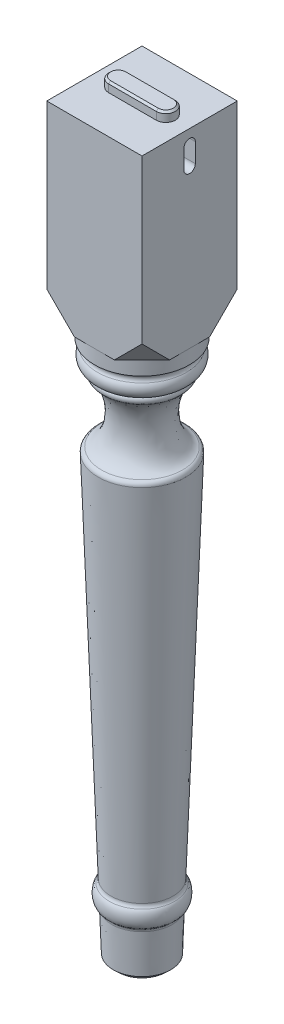
ISO-10303-21;
HEADER;
FILE_DESCRIPTION(('STEP AP214'),'2;1');
FILE_NAME('part.step','',(''),(''),'','','');
FILE_SCHEMA(('AUTOMOTIVE_DESIGN { 1 0 10303 214 1 1 1 1 }'));
ENDSEC;
DATA;
#1=APPLICATION_CONTEXT('core data for automotive mechanical design processes');
#2=APPLICATION_PROTOCOL_DEFINITION('international standard','automotive_design',2000,#1);
#3=PRODUCT_CONTEXT('',#1,'mechanical');
#4=PRODUCT('Part','Part','',(#3));
#5=PRODUCT_RELATED_PRODUCT_CATEGORY('part','',(#4));
#6=PRODUCT_DEFINITION_FORMATION('','',#4);
#7=PRODUCT_DEFINITION_CONTEXT('part definition',#1,'design');
#8=PRODUCT_DEFINITION('design','',#6,#7);
#9=PRODUCT_DEFINITION_SHAPE('','',#8);
#10=(LENGTH_UNIT() NAMED_UNIT(*) SI_UNIT(.MILLI.,.METRE.));
#11=(NAMED_UNIT(*) PLANE_ANGLE_UNIT() SI_UNIT($,.RADIAN.));
#12=(NAMED_UNIT(*) SI_UNIT($,.STERADIAN.) SOLID_ANGLE_UNIT());
#13=UNCERTAINTY_MEASURE_WITH_UNIT(LENGTH_MEASURE(1.E-05),#10,'distance_accuracy_value','');
#14=(GEOMETRIC_REPRESENTATION_CONTEXT(3) GLOBAL_UNCERTAINTY_ASSIGNED_CONTEXT((#13)) GLOBAL_UNIT_ASSIGNED_CONTEXT((#10,
#11,#12)) REPRESENTATION_CONTEXT('',''));
#15=CARTESIAN_POINT('',(0.,0.,0.));
#16=DIRECTION('',(0.,0.,1.));
#17=DIRECTION('',(1.,0.,0.));
#18=AXIS2_PLACEMENT_3D('',#15,#16,#17);
#19=CARTESIAN_POINT('',(0.,0.,0.));
#20=DIRECTION('',(0.,-1.,0.));
#21=DIRECTION('',(0.,0.,-1.));
#22=AXIS2_PLACEMENT_3D('',#19,#20,#21);
#23=PLANE('',#22);
#24=CARTESIAN_POINT('',(0.,0.,0.));
#25=DIRECTION('',(0.,-1.,0.));
#26=DIRECTION('',(0.,0.,-1.));
#27=AXIS2_PLACEMENT_3D('',#24,#25,#26);
#28=CIRCLE('',#27,24.8183506683762);
#29=CARTESIAN_POINT('',(0.,0.,-24.8183506683762));
#30=VERTEX_POINT('',#29);
#31=EDGE_CURVE('E307',#30,#30,#28,.T.);
#32=ORIENTED_EDGE('',*,*,#31,.T.);
#33=EDGE_LOOP('',(#32));
#34=FACE_BOUND('',#33,.T.);
#35=ADVANCED_FACE('F41',(#34),#23,.T.);
#36=CARTESIAN_POINT('',(0.,0.,0.));
#37=DIRECTION('',(0.,1.,0.));
#38=DIRECTION('',(0.,0.,1.));
#39=AXIS2_PLACEMENT_3D('',#36,#37,#38);
#40=CONICAL_SURFACE('',#39,30.,0.0344691009995081);
#41=CARTESIAN_POINT('',(0.,46.8280125464006,0.));
#42=DIRECTION('',(0.,1.,0.));
#43=DIRECTION('',(0.,0.,1.));
#44=AXIS2_PLACEMENT_3D('',#41,#42,#43);
#45=CIRCLE('',#44,31.6147590533242);
#46=CARTESIAN_POINT('',(0.,46.8280125464006,31.6147590533242));
#47=VERTEX_POINT('',#46);
#48=EDGE_CURVE('E292',#47,#47,#45,.F.);
#49=ORIENTED_EDGE('',*,*,#48,.T.);
#50=EDGE_LOOP('',(#49));
#51=FACE_BOUND('',#50,.T.);
#52=CARTESIAN_POINT('',(0.,4.99702999676788,0.));
#53=DIRECTION('',(0.,-1.,0.));
#54=DIRECTION('',(0.,0.,-1.));
#55=AXIS2_PLACEMENT_3D('',#52,#53,#54);
#56=CIRCLE('',#55,30.1723113791989);
#57=CARTESIAN_POINT('',(0.,4.99702999676788,-30.1723113791989));
#58=VERTEX_POINT('',#57);
#59=EDGE_CURVE('E304',#58,#58,#56,.F.);
#60=ORIENTED_EDGE('',*,*,#59,.T.);
#61=EDGE_LOOP('',(#60));
#62=FACE_BOUND('',#61,.T.);
#63=ADVANCED_FACE('F339',(#51,#62),#40,.T.);
#64=CARTESIAN_POINT('',(32.0689655172414,60.,0.));
#65=DIRECTION('',(0.,0.,1.));
#66=DIRECTION('',(0.0344622758397787,0.999405999353588,0.));
#67=AXIS2_PLACEMENT_3D('',#64,#65,#66);
#68=ELLIPSE('',#67,10.0059435369289,5.00297176846444);
#69=CARTESIAN_POINT('',(0.,0.,0.));
#70=DIRECTION('',(0.,-1.,0.));
#71=AXIS1_PLACEMENT('',#69,#70);
#72=SURFACE_OF_REVOLUTION('',#68,#71);
#73=CARTESIAN_POINT('',(0.,69.2136726827971,0.));
#74=DIRECTION('',(0.,-1.,0.));
#75=DIRECTION('',(0.,0.,-1.));
#76=AXIS2_PLACEMENT_3D('',#73,#74,#75);
#77=CIRCLE('',#76,34.2542904177695);
#78=CARTESIAN_POINT('',(0.,69.2136726827971,-34.2542904177695));
#79=VERTEX_POINT('',#78);
#80=EDGE_CURVE('E298',#79,#79,#77,.T.);
#81=ORIENTED_EDGE('',*,*,#80,.T.);
#82=EDGE_LOOP('',(#81));
#83=FACE_BOUND('',#82,.T.);
#84=CARTESIAN_POINT('',(0.,50.6576794563181,0.));
#85=DIRECTION('',(0.,-1.,0.));
#86=DIRECTION('',(0.,0.,-1.));
#87=AXIS2_PLACEMENT_3D('',#84,#85,#86);
#88=CIRCLE('',#87,33.6144285823737);
#89=CARTESIAN_POINT('',(0.,50.6576794563181,-33.6144285823737));
#90=VERTEX_POINT('',#89);
#91=EDGE_CURVE('E301',#90,#90,#88,.F.);
#92=ORIENTED_EDGE('',*,*,#91,.T.);
#93=EDGE_LOOP('',(#92));
#94=FACE_BOUND('',#93,.T.);
#95=ADVANCED_FACE('F335',(#83,#94),#72,.F.);
#96=CARTESIAN_POINT('',(0.,70.,0.));
#97=DIRECTION('',(0.,1.,0.));
#98=DIRECTION('',(0.,0.,1.));
#99=AXIS2_PLACEMENT_3D('',#96,#97,#98);
#100=CONICAL_SURFACE('',#99,32.4137931034483,0.0344691009995079);
#101=CARTESIAN_POINT('',(0.,460.773225628726,0.));
#102=DIRECTION('',(0.,-1.,0.));
#103=DIRECTION('',(0.,0.,-1.));
#104=AXIS2_PLACEMENT_3D('',#101,#102,#103);
#105=CIRCLE('',#104,45.8887319182319);
#106=CARTESIAN_POINT('',(0.,460.773225628726,-45.8887319182319));
#107=VERTEX_POINT('',#106);
#108=EDGE_CURVE('E286',#107,#107,#105,.T.);
#109=ORIENTED_EDGE('',*,*,#108,.T.);
#110=EDGE_LOOP('',(#109));
#111=FACE_BOUND('',#110,.T.);
#112=CARTESIAN_POINT('',(0.,73.1719874535994,0.));
#113=DIRECTION('',(0.,1.,0.));
#114=DIRECTION('',(0.,0.,1.));
#115=AXIS2_PLACEMENT_3D('',#112,#113,#114);
#116=CIRCLE('',#115,32.5231719811586);
#117=CARTESIAN_POINT('',(0.,73.1719874535994,32.5231719811586));
#118=VERTEX_POINT('',#117);
#119=EDGE_CURVE('E295',#118,#118,#116,.T.);
#120=ORIENTED_EDGE('',*,*,#119,.T.);
#121=EDGE_LOOP('',(#120));
#122=FACE_BOUND('',#121,.T.);
#123=ADVANCED_FACE('F330',(#111,#122),#100,.T.);
#124=CARTESIAN_POINT('',(47.2413793103448,500.,0.));
#125=DIRECTION('',(0.,0.,-1.));
#126=DIRECTION('',(-0.0344622758397788,-0.999405999353588,0.));
#127=AXIS2_PLACEMENT_3D('',#124,#125,#126);
#128=ELLIPSE('',#127,35.0208023792512,20.);
#129=CARTESIAN_POINT('',(0.,0.,0.));
#130=DIRECTION('',(0.,-1.,0.));
#131=AXIS1_PLACEMENT('',#129,#130);
#132=SURFACE_OF_REVOLUTION('',#128,#131);
#133=CARTESIAN_POINT('',(0.,465.664216401681,0.));
#134=DIRECTION('',(0.,-1.,0.));
#135=DIRECTION('',(0.,0.,-1.));
#136=AXIS2_PLACEMENT_3D('',#133,#134,#135);
#137=CIRCLE('',#136,42.5452026861877);
#138=CARTESIAN_POINT('',(0.,465.664216401681,-42.5452026861877));
#139=VERTEX_POINT('',#138);
#140=EDGE_CURVE('E283',#139,#139,#137,.F.);
#141=ORIENTED_EDGE('',*,*,#140,.T.);
#142=EDGE_LOOP('',(#141));
#143=FACE_BOUND('',#142,.T.);
#144=CARTESIAN_POINT('',(0.,531.799410173162,0.));
#145=DIRECTION('',(0.,-1.,0.));
#146=DIRECTION('',(0.,0.,-1.));
#147=AXIS2_PLACEMENT_3D('',#144,#145,#146);
#148=CIRCLE('',#147,39.6136701376359);
#149=CARTESIAN_POINT('',(0.,531.799410173162,-39.6136701376359));
#150=VERTEX_POINT('',#149);
#151=EDGE_CURVE('E289',#150,#150,#148,.T.);
#152=ORIENTED_EDGE('',*,*,#151,.T.);
#153=EDGE_LOOP('',(#152));
#154=FACE_BOUND('',#153,.T.);
#155=ADVANCED_FACE('F325',(#143,#154),#132,.F.);
#156=CARTESIAN_POINT('',(0.,550.,0.));
#157=DIRECTION('',(0.,-1.,0.));
#158=DIRECTION('',(0.,0.,-1.));
#159=AXIS2_PLACEMENT_3D('',#156,#157,#158);
#160=TOROIDAL_SURFACE('',#159,39.1003134648673,10.);
#161=CARTESIAN_POINT('',(0.,556.507985231847,0.));
#162=DIRECTION('',(0.,-1.,0.));
#163=DIRECTION('',(0.,0.,-1.));
#164=AXIS2_PLACEMENT_3D('',#161,#162,#163);
#165=CIRCLE('',#164,46.6928182045471);
#166=CARTESIAN_POINT('',(0.,556.507985231847,-46.6928182045471));
#167=VERTEX_POINT('',#166);
#168=EDGE_CURVE('E280',#167,#167,#165,.T.);
#169=ORIENTED_EDGE('',*,*,#168,.T.);
#170=EDGE_LOOP('',(#169));
#171=FACE_BOUND('',#170,.T.);
#172=CARTESIAN_POINT('',(0.,540.,0.));
#173=DIRECTION('',(0.,-1.,0.));
#174=DIRECTION('',(0.,0.,-1.));
#175=AXIS2_PLACEMENT_3D('',#172,#173,#174);
#176=CIRCLE('',#175,39.1003134648673);
#177=CARTESIAN_POINT('',(0.,540.,-39.1003134648673));
#178=VERTEX_POINT('',#177);
#179=EDGE_CURVE('E310',#178,#178,#176,.T.);
#180=ORIENTED_EDGE('',*,*,#179,.F.);
#181=EDGE_LOOP('',(#180));
#182=FACE_BOUND('',#181,.T.);
#183=ADVANCED_FACE('F329',(#171,#182),#160,.T.);
#184=CARTESIAN_POINT('',(0.,560.,0.));
#185=DIRECTION('',(0.,1.,0.));
#186=DIRECTION('',(0.,0.,1.));
#187=AXIS2_PLACEMENT_3D('',#184,#185,#186);
#188=CONICAL_SURFACE('',#187,39.1003134648673,1.1372815251714);
#189=CARTESIAN_POINT('',(0.,564.29945244737,0.));
#190=DIRECTION('',(0.,1.,0.));
#191=DIRECTION('',(0.,0.,1.));
#192=AXIS2_PLACEMENT_3D('',#189,#190,#191);
#193=CIRCLE('',#192,48.3887552985328);
#194=CARTESIAN_POINT('',(0.,564.29945244737,48.3887552985328));
#195=VERTEX_POINT('',#194);
#196=EDGE_CURVE('E277',#195,#195,#193,.T.);
#197=ORIENTED_EDGE('',*,*,#196,.T.);
#198=EDGE_LOOP('',(#197));
#199=FACE_BOUND('',#198,.T.);
#200=CARTESIAN_POINT('',(0.,565.,0.));
#201=DIRECTION('',(0.,-1.,0.));
#202=DIRECTION('',(0.,0.,-1.));
#203=AXIS2_PLACEMENT_3D('',#200,#201,#202);
#204=CIRCLE('',#203,49.9022027139811);
#205=CARTESIAN_POINT('',(0.,565.,-49.9022027139811));
#206=VERTEX_POINT('',#205);
#207=EDGE_CURVE('E313',#206,#206,#204,.T.);
#208=ORIENTED_EDGE('',*,*,#207,.T.);
#209=EDGE_LOOP('',(#208));
#210=FACE_BOUND('',#209,.T.);
#211=ADVANCED_FACE('F587',(#199,#210),#188,.T.);
#212=CARTESIAN_POINT('',(0.,565.,0.));
#213=DIRECTION('',(0.,1.,0.));
#214=DIRECTION('',(0.,0.,1.));
#215=AXIS2_PLACEMENT_3D('',#212,#213,#214);
#216=CONICAL_SURFACE('',#215,49.9022027139811,0.00651972668870377);
#217=CARTESIAN_POINT('',(0.,580.,0.));
#218=DIRECTION('',(0.,-1.,0.));
#219=DIRECTION('',(0.,0.,-1.));
#220=AXIS2_PLACEMENT_3D('',#217,#218,#219);
#221=CIRCLE('',#220,50.);
#222=CARTESIAN_POINT('',(0.,580.,-50.));
#223=VERTEX_POINT('',#222);
#224=CARTESIAN_POINT('',(50.,580.,0.));
#225=VERTEX_POINT('',#224);
#226=EDGE_CURVE('E316',#223,#225,#221,.T.);
#227=ORIENTED_EDGE('',*,*,#226,.T.);
#228=CARTESIAN_POINT('',(0.,580.,50.));
#229=VERTEX_POINT('',#228);
#230=EDGE_CURVE('E319',#225,#229,#221,.T.);
#231=ORIENTED_EDGE('',*,*,#230,.T.);
#232=CARTESIAN_POINT('',(-50.,580.,0.));
#233=VERTEX_POINT('',#232);
#234=EDGE_CURVE('E454',#229,#233,#221,.T.);
#235=ORIENTED_EDGE('',*,*,#234,.T.);
#236=EDGE_CURVE('E205',#233,#223,#221,.T.);
#237=ORIENTED_EDGE('',*,*,#236,.T.);
#238=EDGE_LOOP('',(#227,#231,#235,#237));
#239=FACE_BOUND('',#238,.T.);
#240=ORIENTED_EDGE('',*,*,#207,.F.);
#241=EDGE_LOOP('',(#240));
#242=FACE_BOUND('',#241,.T.);
#243=ADVANCED_FACE('F460',(#239,#242),#216,.T.);
#244=CARTESIAN_POINT('',(0.,580.,0.));
#245=DIRECTION('',(0.,1.,0.));
#246=DIRECTION('',(0.,0.,1.));
#247=AXIS2_PLACEMENT_3D('',#244,#245,#246);
#248=PLANE('',#247);
#249=DIRECTION('',(-0.707106781186548,0.,-0.707106781186548));
#250=VECTOR('',#249,1.);
#251=CARTESIAN_POINT('',(35.5,580.,-35.5));
#252=LINE('',#251,#250);
#253=CARTESIAN_POINT('',(50.,580.,-21.));
#254=VERTEX_POINT('',#253);
#255=CARTESIAN_POINT('',(21.,580.,-50.));
#256=VERTEX_POINT('',#255);
#257=EDGE_CURVE('E244',#254,#256,#252,.T.);
#258=ORIENTED_EDGE('',*,*,#257,.F.);
#259=DIRECTION('',(0.,0.,-1.));
#260=VECTOR('',#259,1.);
#261=CARTESIAN_POINT('',(50.,580.,-50.));
#262=LINE('',#261,#260);
#263=EDGE_CURVE('E424',#225,#254,#262,.T.);
#264=ORIENTED_EDGE('',*,*,#263,.F.);
#265=ORIENTED_EDGE('',*,*,#226,.F.);
#266=DIRECTION('',(-1.,0.,0.));
#267=VECTOR('',#266,1.);
#268=CARTESIAN_POINT('',(-50.,580.,-50.));
#269=LINE('',#268,#267);
#270=EDGE_CURVE('E444',#256,#223,#269,.T.);
#271=ORIENTED_EDGE('',*,*,#270,.F.);
#272=EDGE_LOOP('',(#258,#264,#265,#271));
#273=FACE_BOUND('',#272,.T.);
#274=ADVANCED_FACE('F471',(#273),#248,.F.);
#275=DIRECTION('',(0.707106781186548,0.,-0.707106781186548));
#276=VECTOR('',#275,1.);
#277=CARTESIAN_POINT('',(35.5,580.,35.5));
#278=LINE('',#277,#276);
#279=CARTESIAN_POINT('',(21.,580.,50.));
#280=VERTEX_POINT('',#279);
#281=CARTESIAN_POINT('',(50.,580.,21.0000000000001));
#282=VERTEX_POINT('',#281);
#283=EDGE_CURVE('E235',#280,#282,#278,.T.);
#284=ORIENTED_EDGE('',*,*,#283,.F.);
#285=DIRECTION('',(1.,0.,0.));
#286=VECTOR('',#285,1.);
#287=CARTESIAN_POINT('',(-50.,580.,50.));
#288=LINE('',#287,#286);
#289=EDGE_CURVE('E209',#229,#280,#288,.T.);
#290=ORIENTED_EDGE('',*,*,#289,.F.);
#291=ORIENTED_EDGE('',*,*,#230,.F.);
#292=EDGE_CURVE('E441',#282,#225,#262,.T.);
#293=ORIENTED_EDGE('',*,*,#292,.F.);
#294=EDGE_LOOP('',(#284,#290,#291,#293));
#295=FACE_BOUND('',#294,.T.);
#296=ADVANCED_FACE('F468',(#295),#248,.F.);
#297=DIRECTION('',(0.707106781186548,0.,0.707106781186547));
#298=VECTOR('',#297,1.);
#299=CARTESIAN_POINT('',(-35.5,580.,35.5));
#300=LINE('',#299,#298);
#301=CARTESIAN_POINT('',(-50.,580.,21.));
#302=VERTEX_POINT('',#301);
#303=CARTESIAN_POINT('',(-21.,580.,50.));
#304=VERTEX_POINT('',#303);
#305=EDGE_CURVE('E226',#302,#304,#300,.T.);
#306=ORIENTED_EDGE('',*,*,#305,.F.);
#307=DIRECTION('',(0.,0.,1.));
#308=VECTOR('',#307,1.);
#309=CARTESIAN_POINT('',(-50.,580.,-50.));
#310=LINE('',#309,#308);
#311=EDGE_CURVE('E210',#233,#302,#310,.T.);
#312=ORIENTED_EDGE('',*,*,#311,.F.);
#313=ORIENTED_EDGE('',*,*,#234,.F.);
#314=EDGE_CURVE('E434',#304,#229,#288,.T.);
#315=ORIENTED_EDGE('',*,*,#314,.F.);
#316=EDGE_LOOP('',(#306,#312,#313,#315));
#317=FACE_BOUND('',#316,.T.);
#318=ADVANCED_FACE('F578',(#317),#248,.F.);
#319=CARTESIAN_POINT('',(50.,780.,-50.));
#320=DIRECTION('',(-1.,0.,0.));
#321=DIRECTION('',(0.,0.,1.));
#322=AXIS2_PLACEMENT_3D('',#319,#320,#321);
#323=PLANE('',#322);
#324=DIRECTION('',(0.,0.707106781186548,0.707106781186547));
#325=VECTOR('',#324,1.);
#326=CARTESIAN_POINT('',(50.,644.5,85.5000000000001));
#327=LINE('',#326,#325);
#328=CARTESIAN_POINT('',(50.,609.,50.));
#329=VERTEX_POINT('',#328);
#330=EDGE_CURVE('E232',#282,#329,#327,.T.);
#331=ORIENTED_EDGE('',*,*,#330,.F.);
#332=ORIENTED_EDGE('',*,*,#292,.T.);
#333=ORIENTED_EDGE('',*,*,#263,.T.);
#334=DIRECTION('',(0.,-0.707106781186548,0.707106781186547));
#335=VECTOR('',#334,1.);
#336=CARTESIAN_POINT('',(50.,694.5,-135.5));
#337=LINE('',#336,#335);
#338=CARTESIAN_POINT('',(50.,609.,-50.));
#339=VERTEX_POINT('',#338);
#340=EDGE_CURVE('E241',#339,#254,#337,.T.);
#341=ORIENTED_EDGE('',*,*,#340,.F.);
#342=DIRECTION('',(0.,-1.,0.));
#343=VECTOR('',#342,1.);
#344=CARTESIAN_POINT('',(50.,780.,-50.));
#345=LINE('',#344,#343);
#346=CARTESIAN_POINT('',(50.,780.,-50.));
#347=VERTEX_POINT('',#346);
#348=EDGE_CURVE('E451',#347,#339,#345,.T.);
#349=ORIENTED_EDGE('',*,*,#348,.F.);
#350=DIRECTION('',(0.,0.,-1.));
#351=VECTOR('',#350,1.);
#352=CARTESIAN_POINT('',(50.,780.,-50.));
#353=LINE('',#352,#351);
#354=CARTESIAN_POINT('',(50.,780.,50.));
#355=VERTEX_POINT('',#354);
#356=EDGE_CURVE('E430',#355,#347,#353,.T.);
#357=ORIENTED_EDGE('',*,*,#356,.F.);
#358=DIRECTION('',(0.,-1.,0.));
#359=VECTOR('',#358,1.);
#360=CARTESIAN_POINT('',(50.,780.,50.));
#361=LINE('',#360,#359);
#362=EDGE_CURVE('E440',#355,#329,#361,.T.);
#363=ORIENTED_EDGE('',*,*,#362,.T.);
#364=EDGE_LOOP('',(#331,#332,#333,#341,#349,#357,#363));
#365=FACE_BOUND('',#364,.T.);
#366=DIRECTION('',(0.,-1.,0.));
#367=VECTOR('',#366,1.);
#368=CARTESIAN_POINT('',(50.,765.,5.99999999999999));
#369=LINE('',#368,#367);
#370=CARTESIAN_POINT('',(50.,765.,6.));
#371=VERTEX_POINT('',#370);
#372=CARTESIAN_POINT('',(50.,745.,5.99999999999999));
#373=VERTEX_POINT('',#372);
#374=EDGE_CURVE('E526',#371,#373,#369,.T.);
#375=ORIENTED_EDGE('',*,*,#374,.F.);
#376=CARTESIAN_POINT('',(50.,765.,0.));
#377=DIRECTION('',(1.,0.,0.));
#378=DIRECTION('',(0.,0.,-1.));
#379=AXIS2_PLACEMENT_3D('',#376,#377,#378);
#380=CIRCLE('',#379,6.);
#381=CARTESIAN_POINT('',(50.,765.,-6.00000000000001));
#382=VERTEX_POINT('',#381);
#383=EDGE_CURVE('E504',#382,#371,#380,.T.);
#384=ORIENTED_EDGE('',*,*,#383,.F.);
#385=DIRECTION('',(0.,-1.,0.));
#386=VECTOR('',#385,1.);
#387=CARTESIAN_POINT('',(50.,765.,-6.00000000000001));
#388=LINE('',#387,#386);
#389=CARTESIAN_POINT('',(50.,745.,-6.00000000000001));
#390=VERTEX_POINT('',#389);
#391=EDGE_CURVE('E516',#382,#390,#388,.T.);
#392=ORIENTED_EDGE('',*,*,#391,.T.);
#393=CARTESIAN_POINT('',(50.,745.,0.));
#394=DIRECTION('',(1.,0.,0.));
#395=DIRECTION('',(0.,0.,-1.));
#396=AXIS2_PLACEMENT_3D('',#393,#394,#395);
#397=CIRCLE('',#396,6.);
#398=EDGE_CURVE('E529',#373,#390,#397,.T.);
#399=ORIENTED_EDGE('',*,*,#398,.F.);
#400=EDGE_LOOP('',(#375,#384,#392,#399));
#401=FACE_BOUND('',#400,.T.);
#402=ADVANCED_FACE('F474',(#365,#401),#323,.F.);
#403=CARTESIAN_POINT('',(-50.,780.,-50.));
#404=DIRECTION('',(0.,0.,1.));
#405=DIRECTION('',(1.,0.,0.));
#406=AXIS2_PLACEMENT_3D('',#403,#404,#405);
#407=PLANE('',#406);
#408=DIRECTION('',(0.707106781186547,-0.707106781186548,0.));
#409=VECTOR('',#408,1.);
#410=CARTESIAN_POINT('',(-135.5,694.5,-50.));
#411=LINE('',#410,#409);
#412=CARTESIAN_POINT('',(-50.,609.,-50.));
#413=VERTEX_POINT('',#412);
#414=CARTESIAN_POINT('',(-20.9999999999998,580.,-50.));
#415=VERTEX_POINT('',#414);
#416=EDGE_CURVE('E57',#413,#415,#411,.T.);
#417=ORIENTED_EDGE('',*,*,#416,.F.);
#418=DIRECTION('',(0.,-1.,0.));
#419=VECTOR('',#418,1.);
#420=CARTESIAN_POINT('',(-50.,780.,-50.));
#421=LINE('',#420,#419);
#422=CARTESIAN_POINT('',(-50.,780.,-50.));
#423=VERTEX_POINT('',#422);
#424=EDGE_CURVE('E215',#423,#413,#421,.T.);
#425=ORIENTED_EDGE('',*,*,#424,.F.);
#426=DIRECTION('',(-1.,0.,0.));
#427=VECTOR('',#426,1.);
#428=CARTESIAN_POINT('',(-50.,780.,-50.));
#429=LINE('',#428,#427);
#430=EDGE_CURVE('E433',#347,#423,#429,.T.);
#431=ORIENTED_EDGE('',*,*,#430,.F.);
#432=ORIENTED_EDGE('',*,*,#348,.T.);
#433=DIRECTION('',(0.707106781186547,0.707106781186548,0.));
#434=VECTOR('',#433,1.);
#435=CARTESIAN_POINT('',(85.5,644.5,-50.));
#436=LINE('',#435,#434);
#437=EDGE_CURVE('E238',#256,#339,#436,.T.);
#438=ORIENTED_EDGE('',*,*,#437,.F.);
#439=ORIENTED_EDGE('',*,*,#270,.T.);
#440=EDGE_CURVE('E443',#223,#415,#269,.T.);
#441=ORIENTED_EDGE('',*,*,#440,.T.);
#442=EDGE_LOOP('',(#417,#425,#431,#432,#438,#439,#441));
#443=FACE_BOUND('',#442,.T.);
#444=DIRECTION('',(0.,-1.,0.));
#445=VECTOR('',#444,1.);
#446=CARTESIAN_POINT('',(6.00000000000001,765.,-50.));
#447=LINE('',#446,#445);
#448=CARTESIAN_POINT('',(6.00000000000001,765.,-50.));
#449=VERTEX_POINT('',#448);
#450=CARTESIAN_POINT('',(6.,745.,-50.));
#451=VERTEX_POINT('',#450);
#452=EDGE_CURVE('E486',#449,#451,#447,.T.);
#453=ORIENTED_EDGE('',*,*,#452,.F.);
#454=CARTESIAN_POINT('',(0.,765.,-50.));
#455=DIRECTION('',(0.,0.,-1.));
#456=DIRECTION('',(-1.,0.,0.));
#457=AXIS2_PLACEMENT_3D('',#454,#455,#456);
#458=CIRCLE('',#457,6.);
#459=CARTESIAN_POINT('',(-5.99999999999999,765.,-50.));
#460=VERTEX_POINT('',#459);
#461=EDGE_CURVE('E488',#460,#449,#458,.T.);
#462=ORIENTED_EDGE('',*,*,#461,.F.);
#463=DIRECTION('',(0.,1.,0.));
#464=VECTOR('',#463,1.);
#465=CARTESIAN_POINT('',(-5.99999999999999,765.,-50.));
#466=LINE('',#465,#464);
#467=CARTESIAN_POINT('',(-5.99999999999999,745.,-50.));
#468=VERTEX_POINT('',#467);
#469=EDGE_CURVE('E494',#468,#460,#466,.T.);
#470=ORIENTED_EDGE('',*,*,#469,.F.);
#471=CARTESIAN_POINT('',(0.,745.,-50.));
#472=DIRECTION('',(0.,0.,-1.));
#473=DIRECTION('',(-1.,0.,0.));
#474=AXIS2_PLACEMENT_3D('',#471,#472,#473);
#475=CIRCLE('',#474,6.);
#476=EDGE_CURVE('E490',#451,#468,#475,.T.);
#477=ORIENTED_EDGE('',*,*,#476,.F.);
#478=EDGE_LOOP('',(#453,#462,#470,#477));
#479=FACE_BOUND('',#478,.T.);
#480=ADVANCED_FACE('F478',(#443,#479),#407,.F.);
#481=CARTESIAN_POINT('',(-50.,780.,-50.));
#482=DIRECTION('',(1.,0.,0.));
#483=DIRECTION('',(0.,0.,-1.));
#484=AXIS2_PLACEMENT_3D('',#481,#482,#483);
#485=PLANE('',#484);
#486=DIRECTION('',(0.,0.707106781186548,-0.707106781186547));
#487=VECTOR('',#486,1.);
#488=CARTESIAN_POINT('',(-50.,694.5,-135.5));
#489=LINE('',#488,#487);
#490=CARTESIAN_POINT('',(-50.,580.,-20.9999999999998));
#491=VERTEX_POINT('',#490);
#492=EDGE_CURVE('E50',#491,#413,#489,.T.);
#493=ORIENTED_EDGE('',*,*,#492,.F.);
#494=EDGE_CURVE('E201',#491,#233,#310,.T.);
#495=ORIENTED_EDGE('',*,*,#494,.T.);
#496=ORIENTED_EDGE('',*,*,#311,.T.);
#497=DIRECTION('',(0.,-0.707106781186548,-0.707106781186547));
#498=VECTOR('',#497,1.);
#499=CARTESIAN_POINT('',(-50.,644.5,85.5000000000001));
#500=LINE('',#499,#498);
#501=CARTESIAN_POINT('',(-50.,609.,50.));
#502=VERTEX_POINT('',#501);
#503=EDGE_CURVE('E221',#502,#302,#500,.T.);
#504=ORIENTED_EDGE('',*,*,#503,.F.);
#505=DIRECTION('',(0.,-1.,0.));
#506=VECTOR('',#505,1.);
#507=CARTESIAN_POINT('',(-50.,780.,50.));
#508=LINE('',#507,#506);
#509=CARTESIAN_POINT('',(-50.,780.,50.));
#510=VERTEX_POINT('',#509);
#511=EDGE_CURVE('E449',#510,#502,#508,.T.);
#512=ORIENTED_EDGE('',*,*,#511,.F.);
#513=DIRECTION('',(0.,0.,1.));
#514=VECTOR('',#513,1.);
#515=CARTESIAN_POINT('',(-50.,780.,-50.));
#516=LINE('',#515,#514);
#517=EDGE_CURVE('E436',#423,#510,#516,.T.);
#518=ORIENTED_EDGE('',*,*,#517,.F.);
#519=ORIENTED_EDGE('',*,*,#424,.T.);
#520=EDGE_LOOP('',(#493,#495,#496,#504,#512,#518,#519));
#521=FACE_BOUND('',#520,.T.);
#522=ADVANCED_FACE('F213',(#521),#485,.F.);
#523=CARTESIAN_POINT('',(-50.,780.,50.));
#524=DIRECTION('',(0.,0.,-1.));
#525=DIRECTION('',(-1.,0.,0.));
#526=AXIS2_PLACEMENT_3D('',#523,#524,#525);
#527=PLANE('',#526);
#528=DIRECTION('',(-0.707106781186547,0.707106781186548,0.));
#529=VECTOR('',#528,1.);
#530=CARTESIAN_POINT('',(-135.5,694.5,50.));
#531=LINE('',#530,#529);
#532=EDGE_CURVE('E218',#304,#502,#531,.T.);
#533=ORIENTED_EDGE('',*,*,#532,.F.);
#534=ORIENTED_EDGE('',*,*,#314,.T.);
#535=ORIENTED_EDGE('',*,*,#289,.T.);
#536=DIRECTION('',(-0.707106781186547,-0.707106781186548,0.));
#537=VECTOR('',#536,1.);
#538=CARTESIAN_POINT('',(85.5000000000001,644.5,50.));
#539=LINE('',#538,#537);
#540=EDGE_CURVE('E229',#329,#280,#539,.T.);
#541=ORIENTED_EDGE('',*,*,#540,.F.);
#542=ORIENTED_EDGE('',*,*,#362,.F.);
#543=DIRECTION('',(1.,0.,0.));
#544=VECTOR('',#543,1.);
#545=CARTESIAN_POINT('',(-50.,780.,50.));
#546=LINE('',#545,#544);
#547=EDGE_CURVE('E438',#510,#355,#546,.T.);
#548=ORIENTED_EDGE('',*,*,#547,.F.);
#549=ORIENTED_EDGE('',*,*,#511,.T.);
#550=EDGE_LOOP('',(#533,#534,#535,#541,#542,#548,#549));
#551=FACE_BOUND('',#550,.T.);
#552=ADVANCED_FACE('F575',(#551),#527,.F.);
#553=CARTESIAN_POINT('',(0.,780.,0.));
#554=DIRECTION('',(0.,1.,0.));
#555=DIRECTION('',(0.,0.,1.));
#556=AXIS2_PLACEMENT_3D('',#553,#554,#555);
#557=PLANE('',#556);
#558=CARTESIAN_POINT('',(-25.,780.,0.));
#559=DIRECTION('',(0.,1.,0.));
#560=DIRECTION('',(0.,0.,1.));
#561=AXIS2_PLACEMENT_3D('',#558,#559,#560);
#562=CIRCLE('',#561,10.);
#563=CARTESIAN_POINT('',(-25.,780.,-10.));
#564=VERTEX_POINT('',#563);
#565=CARTESIAN_POINT('',(-25.,780.,10.));
#566=VERTEX_POINT('',#565);
#567=EDGE_CURVE('E251',#564,#566,#562,.T.);
#568=ORIENTED_EDGE('',*,*,#567,.F.);
#569=DIRECTION('',(-1.,0.,0.));
#570=VECTOR('',#569,1.);
#571=CARTESIAN_POINT('',(-25.,780.,-10.));
#572=LINE('',#571,#570);
#573=CARTESIAN_POINT('',(25.,780.,-10.));
#574=VERTEX_POINT('',#573);
#575=EDGE_CURVE('E546',#574,#564,#572,.T.);
#576=ORIENTED_EDGE('',*,*,#575,.F.);
#577=CARTESIAN_POINT('',(25.,780.,0.));
#578=DIRECTION('',(0.,1.,0.));
#579=DIRECTION('',(0.,0.,1.));
#580=AXIS2_PLACEMENT_3D('',#577,#578,#579);
#581=CIRCLE('',#580,10.);
#582=CARTESIAN_POINT('',(25.,780.,10.));
#583=VERTEX_POINT('',#582);
#584=EDGE_CURVE('E544',#583,#574,#581,.T.);
#585=ORIENTED_EDGE('',*,*,#584,.F.);
#586=DIRECTION('',(1.,0.,0.));
#587=VECTOR('',#586,1.);
#588=CARTESIAN_POINT('',(-25.,780.,10.));
#589=LINE('',#588,#587);
#590=EDGE_CURVE('E421',#566,#583,#589,.T.);
#591=ORIENTED_EDGE('',*,*,#590,.F.);
#592=EDGE_LOOP('',(#568,#576,#585,#591));
#593=FACE_BOUND('',#592,.T.);
#594=ORIENTED_EDGE('',*,*,#356,.T.);
#595=ORIENTED_EDGE('',*,*,#430,.T.);
#596=ORIENTED_EDGE('',*,*,#517,.T.);
#597=ORIENTED_EDGE('',*,*,#547,.T.);
#598=EDGE_LOOP('',(#594,#595,#596,#597));
#599=FACE_BOUND('',#598,.T.);
#600=ADVANCED_FACE('F555',(#593,#599),#557,.T.);
#601=DIRECTION('',(-0.707106781186547,0.,0.707106781186548));
#602=VECTOR('',#601,1.);
#603=CARTESIAN_POINT('',(-35.4999999999999,580.,-35.4999999999999));
#604=LINE('',#603,#602);
#605=EDGE_CURVE('E11',#415,#491,#604,.T.);
#606=ORIENTED_EDGE('',*,*,#605,.F.);
#607=ORIENTED_EDGE('',*,*,#440,.F.);
#608=ORIENTED_EDGE('',*,*,#236,.F.);
#609=ORIENTED_EDGE('',*,*,#494,.F.);
#610=EDGE_LOOP('',(#606,#607,#608,#609));
#611=FACE_BOUND('',#610,.T.);
#612=ADVANCED_FACE('F203',(#611),#248,.F.);
#613=CARTESIAN_POINT('',(0.,0.,0.));
#614=DIRECTION('',(0.,1.,0.));
#615=DIRECTION('',(0.,0.,1.));
#616=AXIS2_PLACEMENT_3D('',#613,#614,#615);
#617=CONICAL_SURFACE('',#616,24.8183506683762,0.819867264396957);
#618=ORIENTED_EDGE('',*,*,#59,.F.);
#619=EDGE_LOOP('',(#618));
#620=FACE_BOUND('',#619,.T.);
#621=ORIENTED_EDGE('',*,*,#31,.F.);
#622=EDGE_LOOP('',(#621));
#623=FACE_BOUND('',#622,.T.);
#624=ADVANCED_FACE('F348',(#620,#623),#617,.T.);
#625=CARTESIAN_POINT('',(0.,72.9996760744005,0.));
#626=DIRECTION('',(0.,-1.,0.));
#627=DIRECTION('',(0.,0.,-1.));
#628=AXIS2_PLACEMENT_3D('',#625,#626,#627);
#629=TOROIDAL_SURFACE('',#628,37.5202019779265,5.);
#630=ORIENTED_EDGE('',*,*,#119,.F.);
#631=EDGE_LOOP('',(#630));
#632=FACE_BOUND('',#631,.T.);
#633=ORIENTED_EDGE('',*,*,#80,.F.);
#634=EDGE_LOOP('',(#633));
#635=FACE_BOUND('',#634,.T.);
#636=ADVANCED_FACE('F353',(#632,#635),#629,.F.);
#637=CARTESIAN_POINT('',(0.,46.6557011672017,0.));
#638=DIRECTION('',(0.,-1.,0.));
#639=DIRECTION('',(0.,0.,-1.));
#640=AXIS2_PLACEMENT_3D('',#637,#638,#639);
#641=TOROIDAL_SURFACE('',#640,36.6117890500921,5.);
#642=ORIENTED_EDGE('',*,*,#91,.F.);
#643=EDGE_LOOP('',(#642));
#644=FACE_BOUND('',#643,.T.);
#645=ORIENTED_EDGE('',*,*,#48,.F.);
#646=EDGE_LOOP('',(#645));
#647=FACE_BOUND('',#646,.T.);
#648=ADVANCED_FACE('F357',(#644,#647),#641,.F.);
#649=CARTESIAN_POINT('',(0.,535.721652514531,0.));
#650=DIRECTION('',(0.,-1.,0.));
#651=DIRECTION('',(0.,0.,-1.));
#652=AXIS2_PLACEMENT_3D('',#649,#650,#651);
#653=TOROIDAL_SURFACE('',#652,36.5127001255952,5.);
#654=ORIENTED_EDGE('',*,*,#179,.T.);
#655=EDGE_LOOP('',(#654));
#656=FACE_BOUND('',#655,.T.);
#657=ORIENTED_EDGE('',*,*,#151,.F.);
#658=EDGE_LOOP('',(#657));
#659=FACE_BOUND('',#658,.T.);
#660=ADVANCED_FACE('F361',(#656,#659),#653,.T.);
#661=CARTESIAN_POINT('',(0.,460.945537007924,0.));
#662=DIRECTION('',(0.,1.,0.));
#663=DIRECTION('',(0.,0.,1.));
#664=AXIS2_PLACEMENT_3D('',#661,#662,#663);
#665=TOROIDAL_SURFACE('',#664,40.8917019214639,5.);
#666=ORIENTED_EDGE('',*,*,#140,.F.);
#667=EDGE_LOOP('',(#666));
#668=FACE_BOUND('',#667,.T.);
#669=ORIENTED_EDGE('',*,*,#108,.F.);
#670=EDGE_LOOP('',(#669));
#671=FACE_BOUND('',#670,.T.);
#672=ADVANCED_FACE('F365',(#668,#671),#665,.T.);
#673=CARTESIAN_POINT('',(0.,559.761977847771,0.));
#674=DIRECTION('',(0.,-1.,0.));
#675=DIRECTION('',(0.,0.,-1.));
#676=AXIS2_PLACEMENT_3D('',#673,#674,#675);
#677=TOROIDAL_SURFACE('',#676,50.489070574387,5.);
#678=ORIENTED_EDGE('',*,*,#196,.F.);
#679=EDGE_LOOP('',(#678));
#680=FACE_BOUND('',#679,.T.);
#681=ORIENTED_EDGE('',*,*,#168,.F.);
#682=EDGE_LOOP('',(#681));
#683=FACE_BOUND('',#682,.T.);
#684=ADVANCED_FACE('F369',(#680,#683),#677,.F.);
#685=CARTESIAN_POINT('',(-25.,790.,0.));
#686=DIRECTION('',(0.,-1.,0.));
#687=DIRECTION('',(0.,0.,-1.));
#688=AXIS2_PLACEMENT_3D('',#685,#686,#687);
#689=CYLINDRICAL_SURFACE('',#688,10.);
#690=DIRECTION('',(0.,-1.,0.));
#691=VECTOR('',#690,1.);
#692=CARTESIAN_POINT('',(-25.,790.,10.));
#693=LINE('',#692,#691);
#694=CARTESIAN_POINT('',(-25.,788.,10.));
#695=VERTEX_POINT('',#694);
#696=EDGE_CURVE('E422',#695,#566,#693,.T.);
#697=ORIENTED_EDGE('',*,*,#696,.F.);
#698=CARTESIAN_POINT('',(-25.,788.,0.));
#699=DIRECTION('',(0.,1.,0.));
#700=DIRECTION('',(0.,0.,1.));
#701=AXIS2_PLACEMENT_3D('',#698,#699,#700);
#702=CIRCLE('',#701,10.);
#703=CARTESIAN_POINT('',(-25.,788.,-10.));
#704=VERTEX_POINT('',#703);
#705=EDGE_CURVE('E265',#695,#704,#702,.F.);
#706=ORIENTED_EDGE('',*,*,#705,.T.);
#707=DIRECTION('',(0.,-1.,0.));
#708=VECTOR('',#707,1.);
#709=CARTESIAN_POINT('',(-25.,790.,-10.));
#710=LINE('',#709,#708);
#711=EDGE_CURVE('E426',#704,#564,#710,.T.);
#712=ORIENTED_EDGE('',*,*,#711,.T.);
#713=ORIENTED_EDGE('',*,*,#567,.T.);
#714=EDGE_LOOP('',(#697,#706,#712,#713));
#715=FACE_BOUND('',#714,.T.);
#716=ADVANCED_FACE('F373',(#715),#689,.T.);
#717=CARTESIAN_POINT('',(-25.,790.,10.));
#718=DIRECTION('',(0.,0.,-1.));
#719=DIRECTION('',(-1.,0.,0.));
#720=AXIS2_PLACEMENT_3D('',#717,#718,#719);
#721=PLANE('',#720);
#722=DIRECTION('',(0.,-1.,0.));
#723=VECTOR('',#722,1.);
#724=CARTESIAN_POINT('',(25.,790.,10.));
#725=LINE('',#724,#723);
#726=CARTESIAN_POINT('',(25.,788.,10.));
#727=VERTEX_POINT('',#726);
#728=EDGE_CURVE('E413',#727,#583,#725,.T.);
#729=ORIENTED_EDGE('',*,*,#728,.F.);
#730=DIRECTION('',(-1.,0.,0.));
#731=VECTOR('',#730,1.);
#732=CARTESIAN_POINT('',(-25.,788.,10.));
#733=LINE('',#732,#731);
#734=EDGE_CURVE('E263',#727,#695,#733,.T.);
#735=ORIENTED_EDGE('',*,*,#734,.T.);
#736=ORIENTED_EDGE('',*,*,#696,.T.);
#737=ORIENTED_EDGE('',*,*,#590,.T.);
#738=EDGE_LOOP('',(#729,#735,#736,#737));
#739=FACE_BOUND('',#738,.T.);
#740=ADVANCED_FACE('F418',(#739),#721,.F.);
#741=CARTESIAN_POINT('',(25.,790.,0.));
#742=DIRECTION('',(0.,-1.,0.));
#743=DIRECTION('',(0.,0.,-1.));
#744=AXIS2_PLACEMENT_3D('',#741,#742,#743);
#745=CYLINDRICAL_SURFACE('',#744,10.);
#746=DIRECTION('',(0.,-1.,0.));
#747=VECTOR('',#746,1.);
#748=CARTESIAN_POINT('',(25.,790.,-10.));
#749=LINE('',#748,#747);
#750=CARTESIAN_POINT('',(25.,788.,-10.));
#751=VERTEX_POINT('',#750);
#752=EDGE_CURVE('E415',#751,#574,#749,.T.);
#753=ORIENTED_EDGE('',*,*,#752,.F.);
#754=CARTESIAN_POINT('',(25.,788.,0.));
#755=DIRECTION('',(0.,1.,0.));
#756=DIRECTION('',(0.,0.,1.));
#757=AXIS2_PLACEMENT_3D('',#754,#755,#756);
#758=CIRCLE('',#757,10.);
#759=EDGE_CURVE('E247',#751,#727,#758,.F.);
#760=ORIENTED_EDGE('',*,*,#759,.T.);
#761=ORIENTED_EDGE('',*,*,#728,.T.);
#762=ORIENTED_EDGE('',*,*,#584,.T.);
#763=EDGE_LOOP('',(#753,#760,#761,#762));
#764=FACE_BOUND('',#763,.T.);
#765=ADVANCED_FACE('F411',(#764),#745,.T.);
#766=CARTESIAN_POINT('',(-25.,790.,-10.));
#767=DIRECTION('',(0.,0.,1.));
#768=DIRECTION('',(1.,0.,0.));
#769=AXIS2_PLACEMENT_3D('',#766,#767,#768);
#770=PLANE('',#769);
#771=ORIENTED_EDGE('',*,*,#711,.F.);
#772=DIRECTION('',(1.,0.,0.));
#773=VECTOR('',#772,1.);
#774=CARTESIAN_POINT('',(25.,788.,-10.));
#775=LINE('',#774,#773);
#776=EDGE_CURVE('E261',#704,#751,#775,.T.);
#777=ORIENTED_EDGE('',*,*,#776,.T.);
#778=ORIENTED_EDGE('',*,*,#752,.T.);
#779=ORIENTED_EDGE('',*,*,#575,.T.);
#780=EDGE_LOOP('',(#771,#777,#778,#779));
#781=FACE_BOUND('',#780,.T.);
#782=ADVANCED_FACE('F557',(#781),#770,.F.);
#783=CARTESIAN_POINT('',(-25.,790.,0.));
#784=DIRECTION('',(0.,1.,0.));
#785=DIRECTION('',(0.,0.,1.));
#786=AXIS2_PLACEMENT_3D('',#783,#784,#785);
#787=PLANE('',#786);
#788=DIRECTION('',(-1.,0.,0.));
#789=VECTOR('',#788,1.);
#790=CARTESIAN_POINT('',(-25.,790.,-8.00000000000012));
#791=LINE('',#790,#789);
#792=CARTESIAN_POINT('',(25.,790.,-8.00000000000013));
#793=VERTEX_POINT('',#792);
#794=CARTESIAN_POINT('',(-25.,790.,-8.00000000000012));
#795=VERTEX_POINT('',#794);
#796=EDGE_CURVE('E273',#793,#795,#791,.T.);
#797=ORIENTED_EDGE('',*,*,#796,.T.);
#798=CARTESIAN_POINT('',(-25.,790.,0.));
#799=DIRECTION('',(0.,1.,0.));
#800=DIRECTION('',(0.,0.,1.));
#801=AXIS2_PLACEMENT_3D('',#798,#799,#800);
#802=CIRCLE('',#801,8.00000000000012);
#803=CARTESIAN_POINT('',(-25.,790.,8.00000000000012));
#804=VERTEX_POINT('',#803);
#805=EDGE_CURVE('E268',#795,#804,#802,.T.);
#806=ORIENTED_EDGE('',*,*,#805,.T.);
#807=DIRECTION('',(1.,0.,0.));
#808=VECTOR('',#807,1.);
#809=CARTESIAN_POINT('',(25.,790.,8.00000000000011));
#810=LINE('',#809,#808);
#811=CARTESIAN_POINT('',(25.,790.,8.00000000000011));
#812=VERTEX_POINT('',#811);
#813=EDGE_CURVE('E271',#804,#812,#810,.T.);
#814=ORIENTED_EDGE('',*,*,#813,.T.);
#815=CARTESIAN_POINT('',(25.,790.,0.));
#816=DIRECTION('',(0.,1.,0.));
#817=DIRECTION('',(0.,0.,1.));
#818=AXIS2_PLACEMENT_3D('',#815,#816,#817);
#819=CIRCLE('',#818,8.00000000000012);
#820=EDGE_CURVE('E275',#812,#793,#819,.T.);
#821=ORIENTED_EDGE('',*,*,#820,.T.);
#822=EDGE_LOOP('',(#797,#806,#814,#821));
#823=FACE_BOUND('',#822,.T.);
#824=ADVANCED_FACE('F398',(#823),#787,.T.);
#825=CARTESIAN_POINT('',(25.,790.,0.));
#826=DIRECTION('',(0.,-1.,0.));
#827=DIRECTION('',(0.,0.,-1.));
#828=AXIS2_PLACEMENT_3D('',#825,#826,#827);
#829=CONICAL_SURFACE('',#828,8.00000000000012,0.785398163397448);
#830=DIRECTION('',(0.,0.707106781186547,-0.707106781186547));
#831=VECTOR('',#830,1.);
#832=CARTESIAN_POINT('',(25.,788.,10.));
#833=LINE('',#832,#831);
#834=EDGE_CURVE('E252',#727,#812,#833,.T.);
#835=ORIENTED_EDGE('',*,*,#834,.F.);
#836=ORIENTED_EDGE('',*,*,#759,.F.);
#837=DIRECTION('',(0.,-0.707106781186547,-0.707106781186547));
#838=VECTOR('',#837,1.);
#839=CARTESIAN_POINT('',(25.,790.,-8.00000000000013));
#840=LINE('',#839,#838);
#841=EDGE_CURVE('E248',#793,#751,#840,.T.);
#842=ORIENTED_EDGE('',*,*,#841,.F.);
#843=ORIENTED_EDGE('',*,*,#820,.F.);
#844=EDGE_LOOP('',(#835,#836,#842,#843));
#845=FACE_BOUND('',#844,.T.);
#846=ADVANCED_FACE('F44',(#845),#829,.T.);
#847=CARTESIAN_POINT('',(-25.,790.,-8.00000000000012));
#848=DIRECTION('',(0.,0.707106781186547,-0.707106781186547));
#849=DIRECTION('',(1.,0.,0.));
#850=AXIS2_PLACEMENT_3D('',#847,#848,#849);
#851=PLANE('',#850);
#852=ORIENTED_EDGE('',*,*,#841,.T.);
#853=ORIENTED_EDGE('',*,*,#776,.F.);
#854=DIRECTION('',(0.,-0.707106781186547,-0.707106781186547));
#855=VECTOR('',#854,1.);
#856=CARTESIAN_POINT('',(-25.,790.,-8.00000000000012));
#857=LINE('',#856,#855);
#858=EDGE_CURVE('E255',#795,#704,#857,.T.);
#859=ORIENTED_EDGE('',*,*,#858,.F.);
#860=ORIENTED_EDGE('',*,*,#796,.F.);
#861=EDGE_LOOP('',(#852,#853,#859,#860));
#862=FACE_BOUND('',#861,.T.);
#863=ADVANCED_FACE('F389',(#862),#851,.T.);
#864=CARTESIAN_POINT('',(-25.,790.,8.00000000000012));
#865=DIRECTION('',(0.,0.707106781186547,0.707106781186547));
#866=DIRECTION('',(-1.,0.,0.));
#867=AXIS2_PLACEMENT_3D('',#864,#865,#866);
#868=PLANE('',#867);
#869=ORIENTED_EDGE('',*,*,#834,.T.);
#870=ORIENTED_EDGE('',*,*,#813,.F.);
#871=DIRECTION('',(0.,0.707106781186547,-0.707106781186547));
#872=VECTOR('',#871,1.);
#873=CARTESIAN_POINT('',(-25.,788.,10.));
#874=LINE('',#873,#872);
#875=EDGE_CURVE('E257',#695,#804,#874,.T.);
#876=ORIENTED_EDGE('',*,*,#875,.F.);
#877=ORIENTED_EDGE('',*,*,#734,.F.);
#878=EDGE_LOOP('',(#869,#870,#876,#877));
#879=FACE_BOUND('',#878,.T.);
#880=ADVANCED_FACE('F383',(#879),#868,.T.);
#881=CARTESIAN_POINT('',(-25.,790.,0.));
#882=DIRECTION('',(0.,-1.,0.));
#883=DIRECTION('',(0.,0.,-1.));
#884=AXIS2_PLACEMENT_3D('',#881,#882,#883);
#885=CONICAL_SURFACE('',#884,8.00000000000012,0.785398163397448);
#886=ORIENTED_EDGE('',*,*,#858,.T.);
#887=ORIENTED_EDGE('',*,*,#705,.F.);
#888=ORIENTED_EDGE('',*,*,#875,.T.);
#889=ORIENTED_EDGE('',*,*,#805,.F.);
#890=EDGE_LOOP('',(#886,#887,#888,#889));
#891=FACE_BOUND('',#890,.T.);
#892=ADVANCED_FACE('F376',(#891),#885,.T.);
#893=CARTESIAN_POINT('',(35.,765.,0.));
#894=DIRECTION('',(1.,0.,0.));
#895=DIRECTION('',(0.,0.,-1.));
#896=AXIS2_PLACEMENT_3D('',#893,#894,#895);
#897=CYLINDRICAL_SURFACE('',#896,6.);
#898=ORIENTED_EDGE('',*,*,#383,.T.);
#899=DIRECTION('',(1.,0.,0.));
#900=VECTOR('',#899,1.);
#901=CARTESIAN_POINT('',(35.,765.,6.));
#902=LINE('',#901,#900);
#903=CARTESIAN_POINT('',(35.,765.,6.));
#904=VERTEX_POINT('',#903);
#905=EDGE_CURVE('E524',#904,#371,#902,.T.);
#906=ORIENTED_EDGE('',*,*,#905,.F.);
#907=CARTESIAN_POINT('',(35.,765.,0.));
#908=DIRECTION('',(1.,0.,0.));
#909=DIRECTION('',(0.,0.,-1.));
#910=AXIS2_PLACEMENT_3D('',#907,#908,#909);
#911=CIRCLE('',#910,6.);
#912=CARTESIAN_POINT('',(35.,765.,-6.));
#913=VERTEX_POINT('',#912);
#914=EDGE_CURVE('E512',#913,#904,#911,.T.);
#915=ORIENTED_EDGE('',*,*,#914,.F.);
#916=DIRECTION('',(1.,0.,0.));
#917=VECTOR('',#916,1.);
#918=CARTESIAN_POINT('',(35.,765.,-6.));
#919=LINE('',#918,#917);
#920=EDGE_CURVE('E259',#913,#382,#919,.T.);
#921=ORIENTED_EDGE('',*,*,#920,.T.);
#922=EDGE_LOOP('',(#898,#906,#915,#921));
#923=FACE_BOUND('',#922,.T.);
#924=ADVANCED_FACE('F382',(#923),#897,.F.);
#925=CARTESIAN_POINT('',(35.,765.,-6.));
#926=DIRECTION('',(0.,0.,1.));
#927=DIRECTION('',(1.,0.,0.));
#928=AXIS2_PLACEMENT_3D('',#925,#926,#927);
#929=PLANE('',#928);
#930=ORIENTED_EDGE('',*,*,#391,.F.);
#931=ORIENTED_EDGE('',*,*,#920,.F.);
#932=DIRECTION('',(0.,-1.,0.));
#933=VECTOR('',#932,1.);
#934=CARTESIAN_POINT('',(35.,765.,-6.));
#935=LINE('',#934,#933);
#936=CARTESIAN_POINT('',(35.,745.,-6.00000000000001));
#937=VERTEX_POINT('',#936);
#938=EDGE_CURVE('E522',#913,#937,#935,.T.);
#939=ORIENTED_EDGE('',*,*,#938,.T.);
#940=DIRECTION('',(1.,0.,0.));
#941=VECTOR('',#940,1.);
#942=CARTESIAN_POINT('',(35.,745.,-6.00000000000001));
#943=LINE('',#942,#941);
#944=EDGE_CURVE('E535',#937,#390,#943,.T.);
#945=ORIENTED_EDGE('',*,*,#944,.T.);
#946=EDGE_LOOP('',(#930,#931,#939,#945));
#947=FACE_BOUND('',#946,.T.);
#948=ADVANCED_FACE('F784',(#947),#929,.T.);
#949=CARTESIAN_POINT('',(35.,745.,0.));
#950=DIRECTION('',(1.,0.,0.));
#951=DIRECTION('',(0.,0.,-1.));
#952=AXIS2_PLACEMENT_3D('',#949,#950,#951);
#953=CYLINDRICAL_SURFACE('',#952,6.);
#954=ORIENTED_EDGE('',*,*,#398,.T.);
#955=ORIENTED_EDGE('',*,*,#944,.F.);
#956=CARTESIAN_POINT('',(35.,745.,0.));
#957=DIRECTION('',(1.,0.,0.));
#958=DIRECTION('',(0.,0.,-1.));
#959=AXIS2_PLACEMENT_3D('',#956,#957,#958);
#960=CIRCLE('',#959,6.);
#961=CARTESIAN_POINT('',(35.,745.,5.99999999999999));
#962=VERTEX_POINT('',#961);
#963=EDGE_CURVE('E519',#962,#937,#960,.T.);
#964=ORIENTED_EDGE('',*,*,#963,.F.);
#965=DIRECTION('',(1.,0.,0.));
#966=VECTOR('',#965,1.);
#967=CARTESIAN_POINT('',(35.,745.,5.99999999999999));
#968=LINE('',#967,#966);
#969=EDGE_CURVE('E537',#962,#373,#968,.T.);
#970=ORIENTED_EDGE('',*,*,#969,.T.);
#971=EDGE_LOOP('',(#954,#955,#964,#970));
#972=FACE_BOUND('',#971,.T.);
#973=ADVANCED_FACE('F776',(#972),#953,.F.);
#974=CARTESIAN_POINT('',(35.,765.,6.));
#975=DIRECTION('',(0.,0.,1.));
#976=DIRECTION('',(0.,-1.,0.));
#977=AXIS2_PLACEMENT_3D('',#974,#975,#976);
#978=PLANE('',#977);
#979=ORIENTED_EDGE('',*,*,#374,.T.);
#980=ORIENTED_EDGE('',*,*,#969,.F.);
#981=DIRECTION('',(0.,-1.,0.));
#982=VECTOR('',#981,1.);
#983=CARTESIAN_POINT('',(35.,765.,6.));
#984=LINE('',#983,#982);
#985=EDGE_CURVE('E515',#904,#962,#984,.T.);
#986=ORIENTED_EDGE('',*,*,#985,.F.);
#987=ORIENTED_EDGE('',*,*,#905,.T.);
#988=EDGE_LOOP('',(#979,#980,#986,#987));
#989=FACE_BOUND('',#988,.T.);
#990=ADVANCED_FACE('F768',(#989),#978,.F.);
#991=CARTESIAN_POINT('',(35.,765.,0.));
#992=DIRECTION('',(1.,0.,0.));
#993=DIRECTION('',(0.,0.,-1.));
#994=AXIS2_PLACEMENT_3D('',#991,#992,#993);
#995=PLANE('',#994);
#996=ORIENTED_EDGE('',*,*,#914,.T.);
#997=ORIENTED_EDGE('',*,*,#985,.T.);
#998=ORIENTED_EDGE('',*,*,#963,.T.);
#999=ORIENTED_EDGE('',*,*,#938,.F.);
#1000=EDGE_LOOP('',(#996,#997,#998,#999));
#1001=FACE_BOUND('',#1000,.T.);
#1002=ADVANCED_FACE('F760',(#1001),#995,.T.);
#1003=CARTESIAN_POINT('',(0.,765.,-35.));
#1004=DIRECTION('',(0.,0.,-1.));
#1005=DIRECTION('',(-1.,0.,0.));
#1006=AXIS2_PLACEMENT_3D('',#1003,#1004,#1005);
#1007=CYLINDRICAL_SURFACE('',#1006,6.);
#1008=ORIENTED_EDGE('',*,*,#461,.T.);
#1009=DIRECTION('',(0.,0.,-1.));
#1010=VECTOR('',#1009,1.);
#1011=CARTESIAN_POINT('',(6.00000000000001,765.,-35.));
#1012=LINE('',#1011,#1010);
#1013=CARTESIAN_POINT('',(6.00000000000001,765.,-35.));
#1014=VERTEX_POINT('',#1013);
#1015=EDGE_CURVE('E509',#1014,#449,#1012,.T.);
#1016=ORIENTED_EDGE('',*,*,#1015,.F.);
#1017=CARTESIAN_POINT('',(0.,765.,-35.));
#1018=DIRECTION('',(0.,0.,-1.));
#1019=DIRECTION('',(-1.,0.,0.));
#1020=AXIS2_PLACEMENT_3D('',#1017,#1018,#1019);
#1021=CIRCLE('',#1020,6.);
#1022=CARTESIAN_POINT('',(-5.99999999999999,765.,-35.));
#1023=VERTEX_POINT('',#1022);
#1024=EDGE_CURVE('E501',#1023,#1014,#1021,.T.);
#1025=ORIENTED_EDGE('',*,*,#1024,.F.);
#1026=DIRECTION('',(0.,0.,-1.));
#1027=VECTOR('',#1026,1.);
#1028=CARTESIAN_POINT('',(-5.99999999999999,765.,-35.));
#1029=LINE('',#1028,#1027);
#1030=EDGE_CURVE('E502',#1023,#460,#1029,.T.);
#1031=ORIENTED_EDGE('',*,*,#1030,.T.);
#1032=EDGE_LOOP('',(#1008,#1016,#1025,#1031));
#1033=FACE_BOUND('',#1032,.T.);
#1034=ADVANCED_FACE('F752',(#1033),#1007,.F.);
#1035=CARTESIAN_POINT('',(-5.99999999999999,765.,-35.));
#1036=DIRECTION('',(-1.,0.,0.));
#1037=DIRECTION('',(0.,-1.,0.));
#1038=AXIS2_PLACEMENT_3D('',#1035,#1036,#1037);
#1039=PLANE('',#1038);
#1040=ORIENTED_EDGE('',*,*,#469,.T.);
#1041=ORIENTED_EDGE('',*,*,#1030,.F.);
#1042=DIRECTION('',(0.,1.,0.));
#1043=VECTOR('',#1042,1.);
#1044=CARTESIAN_POINT('',(-5.99999999999999,765.,-35.));
#1045=LINE('',#1044,#1043);
#1046=CARTESIAN_POINT('',(-5.99999999999999,745.,-35.));
#1047=VERTEX_POINT('',#1046);
#1048=EDGE_CURVE('E511',#1047,#1023,#1045,.T.);
#1049=ORIENTED_EDGE('',*,*,#1048,.F.);
#1050=DIRECTION('',(0.,0.,-1.));
#1051=VECTOR('',#1050,1.);
#1052=CARTESIAN_POINT('',(-5.99999999999999,745.,-35.));
#1053=LINE('',#1052,#1051);
#1054=EDGE_CURVE('E505',#1047,#468,#1053,.T.);
#1055=ORIENTED_EDGE('',*,*,#1054,.T.);
#1056=EDGE_LOOP('',(#1040,#1041,#1049,#1055));
#1057=FACE_BOUND('',#1056,.T.);
#1058=ADVANCED_FACE('F744',(#1057),#1039,.F.);
#1059=CARTESIAN_POINT('',(0.,745.,-35.));
#1060=DIRECTION('',(0.,0.,-1.));
#1061=DIRECTION('',(-1.,0.,0.));
#1062=AXIS2_PLACEMENT_3D('',#1059,#1060,#1061);
#1063=CYLINDRICAL_SURFACE('',#1062,6.);
#1064=ORIENTED_EDGE('',*,*,#476,.T.);
#1065=ORIENTED_EDGE('',*,*,#1054,.F.);
#1066=CARTESIAN_POINT('',(0.,745.,-35.));
#1067=DIRECTION('',(0.,0.,-1.));
#1068=DIRECTION('',(-1.,0.,0.));
#1069=AXIS2_PLACEMENT_3D('',#1066,#1067,#1068);
#1070=CIRCLE('',#1069,6.);
#1071=CARTESIAN_POINT('',(6.,745.,-35.));
#1072=VERTEX_POINT('',#1071);
#1073=EDGE_CURVE('E851',#1072,#1047,#1070,.T.);
#1074=ORIENTED_EDGE('',*,*,#1073,.F.);
#1075=DIRECTION('',(0.,0.,-1.));
#1076=VECTOR('',#1075,1.);
#1077=CARTESIAN_POINT('',(6.,745.,-35.));
#1078=LINE('',#1077,#1076);
#1079=EDGE_CURVE('E507',#1072,#451,#1078,.T.);
#1080=ORIENTED_EDGE('',*,*,#1079,.T.);
#1081=EDGE_LOOP('',(#1064,#1065,#1074,#1080));
#1082=FACE_BOUND('',#1081,.T.);
#1083=ADVANCED_FACE('F737',(#1082),#1063,.F.);
#1084=CARTESIAN_POINT('',(6.00000000000001,765.,-35.));
#1085=DIRECTION('',(1.,0.,0.));
#1086=DIRECTION('',(0.,1.,0.));
#1087=AXIS2_PLACEMENT_3D('',#1084,#1085,#1086);
#1088=PLANE('',#1087);
#1089=ORIENTED_EDGE('',*,*,#452,.T.);
#1090=ORIENTED_EDGE('',*,*,#1079,.F.);
#1091=DIRECTION('',(0.,-1.,0.));
#1092=VECTOR('',#1091,1.);
#1093=CARTESIAN_POINT('',(6.00000000000001,765.,-35.));
#1094=LINE('',#1093,#1092);
#1095=EDGE_CURVE('E847',#1014,#1072,#1094,.T.);
#1096=ORIENTED_EDGE('',*,*,#1095,.F.);
#1097=ORIENTED_EDGE('',*,*,#1015,.T.);
#1098=EDGE_LOOP('',(#1089,#1090,#1096,#1097));
#1099=FACE_BOUND('',#1098,.T.);
#1100=ADVANCED_FACE('F729',(#1099),#1088,.F.);
#1101=CARTESIAN_POINT('',(0.,765.,-35.));
#1102=DIRECTION('',(0.,0.,-1.));
#1103=DIRECTION('',(-1.,0.,0.));
#1104=AXIS2_PLACEMENT_3D('',#1101,#1102,#1103);
#1105=PLANE('',#1104);
#1106=ORIENTED_EDGE('',*,*,#1024,.T.);
#1107=ORIENTED_EDGE('',*,*,#1095,.T.);
#1108=ORIENTED_EDGE('',*,*,#1073,.T.);
#1109=ORIENTED_EDGE('',*,*,#1048,.T.);
#1110=EDGE_LOOP('',(#1106,#1107,#1108,#1109));
#1111=FACE_BOUND('',#1110,.T.);
#1112=ADVANCED_FACE('F723',(#1111),#1105,.T.);
#1113=CARTESIAN_POINT('',(-169.666666666667,169.666666666666,169.666666666667));
#1114=DIRECTION('',(0.577350269189626,-0.577350269189625,-0.577350269189626));
#1115=DIRECTION('',(-0.707106781186548,0.,-0.707106781186548));
#1116=AXIS2_PLACEMENT_3D('',#1113,#1114,#1115);
#1117=PLANE('',#1116);
#1118=ORIENTED_EDGE('',*,*,#340,.T.);
#1119=ORIENTED_EDGE('',*,*,#257,.T.);
#1120=ORIENTED_EDGE('',*,*,#437,.T.);
#1121=EDGE_LOOP('',(#1118,#1119,#1120));
#1122=FACE_BOUND('',#1121,.T.);
#1123=ADVANCED_FACE('F477',(#1122),#1117,.T.);
#1124=CARTESIAN_POINT('',(-169.666666666667,169.666666666666,-169.666666666667));
#1125=DIRECTION('',(0.577350269189626,-0.577350269189625,0.577350269189626));
#1126=DIRECTION('',(0.707106781186548,0.,-0.707106781186548));
#1127=AXIS2_PLACEMENT_3D('',#1124,#1125,#1126);
#1128=PLANE('',#1127);
#1129=ORIENTED_EDGE('',*,*,#540,.T.);
#1130=ORIENTED_EDGE('',*,*,#283,.T.);
#1131=ORIENTED_EDGE('',*,*,#330,.T.);
#1132=EDGE_LOOP('',(#1129,#1130,#1131));
#1133=FACE_BOUND('',#1132,.T.);
#1134=ADVANCED_FACE('F710',(#1133),#1128,.T.);
#1135=CARTESIAN_POINT('',(169.666666666666,169.666666666666,-169.666666666667));
#1136=DIRECTION('',(-0.577350269189626,-0.577350269189625,0.577350269189626));
#1137=DIRECTION('',(0.707106781186548,0.,0.707106781186547));
#1138=AXIS2_PLACEMENT_3D('',#1135,#1136,#1137);
#1139=PLANE('',#1138);
#1140=ORIENTED_EDGE('',*,*,#503,.T.);
#1141=ORIENTED_EDGE('',*,*,#305,.T.);
#1142=ORIENTED_EDGE('',*,*,#532,.T.);
#1143=EDGE_LOOP('',(#1140,#1141,#1142));
#1144=FACE_BOUND('',#1143,.T.);
#1145=ADVANCED_FACE('F702',(#1144),#1139,.T.);
#1146=CARTESIAN_POINT('',(169.666666666667,169.666666666666,169.666666666667));
#1147=DIRECTION('',(-0.577350269189626,-0.577350269189625,-0.577350269189626));
#1148=DIRECTION('',(-0.707106781186547,0.,0.707106781186548));
#1149=AXIS2_PLACEMENT_3D('',#1146,#1147,#1148);
#1150=PLANE('',#1149);
#1151=ORIENTED_EDGE('',*,*,#492,.T.);
#1152=ORIENTED_EDGE('',*,*,#416,.T.);
#1153=ORIENTED_EDGE('',*,*,#605,.T.);
#1154=EDGE_LOOP('',(#1151,#1152,#1153));
#1155=FACE_BOUND('',#1154,.T.);
#1156=ADVANCED_FACE('F217',(#1155),#1150,.T.);
#1157=CLOSED_SHELL('',(#35,#63,#95,#123,#155,#183,#211,#243,#274,#296,#318,#402,#480,#522,#552,
#600,#612,#624,#636,#648,#660,#672,#684,#716,#740,#765,#782,#824,#846,#863,#880,#892,#924,#948,
#973,#990,#1002,#1034,#1058,#1083,#1100,#1112,#1123,#1134,#1145,#1156));
#1158=MANIFOLD_SOLID_BREP('B2',#1157);
#1159=ADVANCED_BREP_SHAPE_REPRESENTATION('',(#18,#1158),#14);
#1160=SHAPE_DEFINITION_REPRESENTATION(#9,#1159);
ENDSEC;
END-ISO-10303-21;
